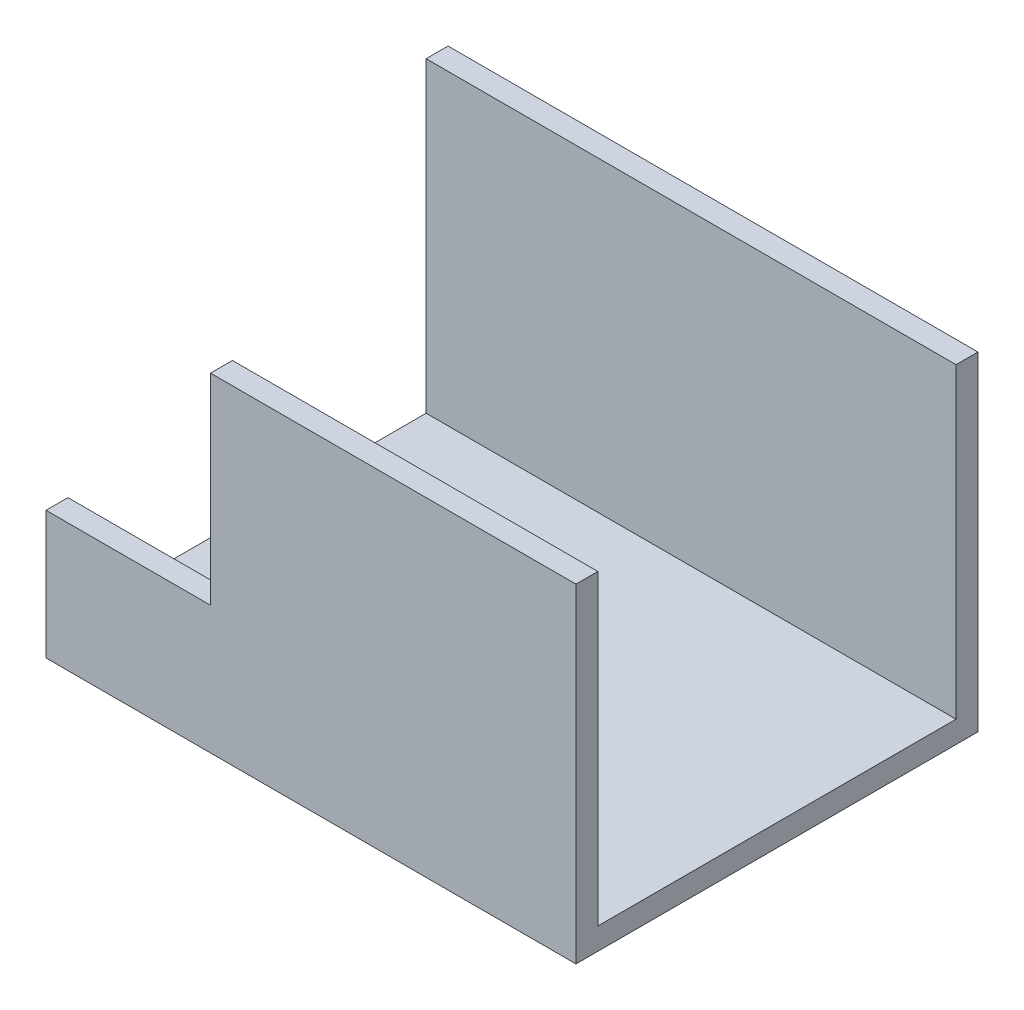
ISO-10303-21;
HEADER;
FILE_DESCRIPTION(('STEP AP214'),'2;1');
FILE_NAME('part.step','',(''),(''),'','','');
FILE_SCHEMA(('AUTOMOTIVE_DESIGN { 1 0 10303 214 1 1 1 1 }'));
ENDSEC;
DATA;
#1=APPLICATION_CONTEXT('core data for automotive mechanical design processes');
#2=APPLICATION_PROTOCOL_DEFINITION('international standard','automotive_design',2000,#1);
#3=PRODUCT_CONTEXT('',#1,'mechanical');
#4=PRODUCT('Part','Part','',(#3));
#5=PRODUCT_RELATED_PRODUCT_CATEGORY('part','',(#4));
#6=PRODUCT_DEFINITION_FORMATION('','',#4);
#7=PRODUCT_DEFINITION_CONTEXT('part definition',#1,'design');
#8=PRODUCT_DEFINITION('design','',#6,#7);
#9=PRODUCT_DEFINITION_SHAPE('','',#8);
#10=(LENGTH_UNIT() NAMED_UNIT(*) SI_UNIT(.MILLI.,.METRE.));
#11=(NAMED_UNIT(*) PLANE_ANGLE_UNIT() SI_UNIT($,.RADIAN.));
#12=(NAMED_UNIT(*) SI_UNIT($,.STERADIAN.) SOLID_ANGLE_UNIT());
#13=UNCERTAINTY_MEASURE_WITH_UNIT(LENGTH_MEASURE(1.E-05),#10,'distance_accuracy_value','');
#14=(GEOMETRIC_REPRESENTATION_CONTEXT(3) GLOBAL_UNCERTAINTY_ASSIGNED_CONTEXT((#13)) GLOBAL_UNIT_ASSIGNED_CONTEXT((#10,
#11,#12)) REPRESENTATION_CONTEXT('',''));
#15=CARTESIAN_POINT('',(0.,0.,0.));
#16=DIRECTION('',(0.,0.,1.));
#17=DIRECTION('',(1.,0.,0.));
#18=AXIS2_PLACEMENT_3D('',#15,#16,#17);
#19=CARTESIAN_POINT('',(-0.15,0.005,0.));
#20=DIRECTION('',(0.,-1.,0.));
#21=DIRECTION('',(0.707106781186548,0.,0.707106781186548));
#22=AXIS2_PLACEMENT_3D('',#19,#20,#21);
#23=PLANE('',#22);
#24=DIRECTION('',(1.,0.,0.));
#25=VECTOR('',#24,1.);
#26=CARTESIAN_POINT('',(-0.375,0.005,0.03));
#27=LINE('',#26,#25);
#28=CARTESIAN_POINT('',(-0.375,0.005,0.03));
#29=VERTEX_POINT('',#28);
#30=CARTESIAN_POINT('',(0.35,0.005,0.03));
#31=VERTEX_POINT('',#30);
#32=EDGE_CURVE('E154',#29,#31,#27,.T.);
#33=ORIENTED_EDGE('',*,*,#32,.F.);
#34=DIRECTION('',(0.,0.,-1.));
#35=VECTOR('',#34,1.);
#36=CARTESIAN_POINT('',(-0.375,0.005,0.52));
#37=LINE('',#36,#35);
#38=CARTESIAN_POINT('',(-0.375,0.00500000000000011,0.52));
#39=VERTEX_POINT('',#38);
#40=EDGE_CURVE('E35',#39,#29,#37,.T.);
#41=ORIENTED_EDGE('',*,*,#40,.F.);
#42=DIRECTION('',(1.,0.,0.));
#43=VECTOR('',#42,1.);
#44=CARTESIAN_POINT('',(-0.375,0.00500000000000012,0.52));
#45=LINE('',#44,#43);
#46=CARTESIAN_POINT('',(0.35,0.005,0.52));
#47=VERTEX_POINT('',#46);
#48=EDGE_CURVE('E11',#39,#47,#45,.T.);
#49=ORIENTED_EDGE('',*,*,#48,.T.);
#50=DIRECTION('',(0.,0.,1.));
#51=VECTOR('',#50,1.);
#52=CARTESIAN_POINT('',(0.35,0.005,0.03));
#53=LINE('',#52,#51);
#54=EDGE_CURVE('E140',#31,#47,#53,.T.);
#55=ORIENTED_EDGE('',*,*,#54,.F.);
#56=EDGE_LOOP('',(#33,#41,#49,#55));
#57=FACE_BOUND('',#56,.T.);
#58=ADVANCED_FACE('F16',(#57),#23,.F.);
#59=CARTESIAN_POINT('',(0.,0.,0.52));
#60=DIRECTION('',(0.,0.,1.));
#61=DIRECTION('',(0.707106781186548,0.707106781186548,0.));
#62=AXIS2_PLACEMENT_3D('',#59,#60,#61);
#63=PLANE('',#62);
#64=DIRECTION('',(-1.,0.,0.));
#65=VECTOR('',#64,1.);
#66=CARTESIAN_POINT('',(0.35,0.425,0.52));
#67=LINE('',#66,#65);
#68=CARTESIAN_POINT('',(0.35,0.425,0.52));
#69=VERTEX_POINT('',#68);
#70=CARTESIAN_POINT('',(-0.15,0.425,0.52));
#71=VERTEX_POINT('',#70);
#72=EDGE_CURVE('E133',#69,#71,#67,.T.);
#73=ORIENTED_EDGE('',*,*,#72,.F.);
#74=DIRECTION('',(0.,1.,0.));
#75=VECTOR('',#74,1.);
#76=CARTESIAN_POINT('',(0.35,0.005,0.52));
#77=LINE('',#76,#75);
#78=EDGE_CURVE('E144',#47,#69,#77,.T.);
#79=ORIENTED_EDGE('',*,*,#78,.F.);
#80=ORIENTED_EDGE('',*,*,#48,.F.);
#81=DIRECTION('',(0.,-1.,0.));
#82=VECTOR('',#81,1.);
#83=CARTESIAN_POINT('',(-0.375,0.15,0.52));
#84=LINE('',#83,#82);
#85=CARTESIAN_POINT('',(-0.375,0.15,0.52));
#86=VERTEX_POINT('',#85);
#87=EDGE_CURVE('E136',#86,#39,#84,.T.);
#88=ORIENTED_EDGE('',*,*,#87,.F.);
#89=DIRECTION('',(-1.,0.,0.));
#90=VECTOR('',#89,1.);
#91=CARTESIAN_POINT('',(-0.15,0.15,0.52));
#92=LINE('',#91,#90);
#93=CARTESIAN_POINT('',(-0.15,0.15,0.52));
#94=VERTEX_POINT('',#93);
#95=EDGE_CURVE('E130',#94,#86,#92,.T.);
#96=ORIENTED_EDGE('',*,*,#95,.F.);
#97=DIRECTION('',(0.,-1.,0.));
#98=VECTOR('',#97,1.);
#99=CARTESIAN_POINT('',(-0.15,0.425,0.52));
#100=LINE('',#99,#98);
#101=EDGE_CURVE('E118',#71,#94,#100,.T.);
#102=ORIENTED_EDGE('',*,*,#101,.F.);
#103=EDGE_LOOP('',(#73,#79,#80,#88,#96,#102));
#104=FACE_BOUND('',#103,.T.);
#105=ADVANCED_FACE('F177',(#104),#63,.F.);
#106=CARTESIAN_POINT('',(0.,0.,0.03));
#107=DIRECTION('',(0.,0.,1.));
#108=DIRECTION('',(0.707106781186548,0.707106781186548,0.));
#109=AXIS2_PLACEMENT_3D('',#106,#107,#108);
#110=PLANE('',#109);
#111=DIRECTION('',(0.,1.,0.));
#112=VECTOR('',#111,1.);
#113=CARTESIAN_POINT('',(0.35,0.005,0.03));
#114=LINE('',#113,#112);
#115=CARTESIAN_POINT('',(0.35,0.425,0.03));
#116=VERTEX_POINT('',#115);
#117=EDGE_CURVE('E26',#31,#116,#114,.T.);
#118=ORIENTED_EDGE('',*,*,#117,.T.);
#119=DIRECTION('',(-1.,0.,0.));
#120=VECTOR('',#119,1.);
#121=CARTESIAN_POINT('',(0.35,0.425,0.03));
#122=LINE('',#121,#120);
#123=CARTESIAN_POINT('',(-0.375,0.425,0.03));
#124=VERTEX_POINT('',#123);
#125=EDGE_CURVE('E151',#116,#124,#122,.T.);
#126=ORIENTED_EDGE('',*,*,#125,.T.);
#127=DIRECTION('',(0.,1.,0.));
#128=VECTOR('',#127,1.);
#129=CARTESIAN_POINT('',(-0.375,0.005,0.03));
#130=LINE('',#129,#128);
#131=EDGE_CURVE('E147',#29,#124,#130,.T.);
#132=ORIENTED_EDGE('',*,*,#131,.F.);
#133=ORIENTED_EDGE('',*,*,#32,.T.);
#134=EDGE_LOOP('',(#118,#126,#132,#133));
#135=FACE_BOUND('',#134,.T.);
#136=ADVANCED_FACE('F189',(#135),#110,.T.);
#137=CARTESIAN_POINT('',(0.35,0.425,0.));
#138=DIRECTION('',(0.,1.,0.));
#139=DIRECTION('',(0.707106781186548,0.,0.707106781186548));
#140=AXIS2_PLACEMENT_3D('',#137,#138,#139);
#141=PLANE('',#140);
#142=ORIENTED_EDGE('',*,*,#125,.F.);
#143=DIRECTION('',(0.,0.,1.));
#144=VECTOR('',#143,1.);
#145=CARTESIAN_POINT('',(0.35,0.425,0.));
#146=LINE('',#145,#144);
#147=CARTESIAN_POINT('',(0.35,0.425,0.));
#148=VERTEX_POINT('',#147);
#149=EDGE_CURVE('E157',#148,#116,#146,.T.);
#150=ORIENTED_EDGE('',*,*,#149,.F.);
#151=DIRECTION('',(-1.,0.,0.));
#152=VECTOR('',#151,1.);
#153=CARTESIAN_POINT('',(0.35,0.425,0.));
#154=LINE('',#153,#152);
#155=CARTESIAN_POINT('',(-0.375,0.425,0.));
#156=VERTEX_POINT('',#155);
#157=EDGE_CURVE('E161',#148,#156,#154,.T.);
#158=ORIENTED_EDGE('',*,*,#157,.T.);
#159=DIRECTION('',(0.,0.,-1.));
#160=VECTOR('',#159,1.);
#161=CARTESIAN_POINT('',(-0.375,0.425,0.03));
#162=LINE('',#161,#160);
#163=EDGE_CURVE('E156',#124,#156,#162,.T.);
#164=ORIENTED_EDGE('',*,*,#163,.F.);
#165=EDGE_LOOP('',(#142,#150,#158,#164));
#166=FACE_BOUND('',#165,.T.);
#167=ADVANCED_FACE('F193',(#166),#141,.T.);
#168=CARTESIAN_POINT('',(0.,0.,0.));
#169=DIRECTION('',(0.,0.,1.));
#170=DIRECTION('',(0.707106781186548,0.707106781186548,0.));
#171=AXIS2_PLACEMENT_3D('',#168,#169,#170);
#172=PLANE('',#171);
#173=DIRECTION('',(0.,1.,0.));
#174=VECTOR('',#173,1.);
#175=CARTESIAN_POINT('',(0.35,-0.025,0.));
#176=LINE('',#175,#174);
#177=CARTESIAN_POINT('',(0.35,-0.025,0.));
#178=VERTEX_POINT('',#177);
#179=EDGE_CURVE('E160',#178,#148,#176,.T.);
#180=ORIENTED_EDGE('',*,*,#179,.F.);
#181=DIRECTION('',(1.,0.,0.));
#182=VECTOR('',#181,1.);
#183=CARTESIAN_POINT('',(-0.375,-0.025,0.));
#184=LINE('',#183,#182);
#185=CARTESIAN_POINT('',(-0.375,-0.025,0.));
#186=VERTEX_POINT('',#185);
#187=EDGE_CURVE('E107',#186,#178,#184,.T.);
#188=ORIENTED_EDGE('',*,*,#187,.F.);
#189=DIRECTION('',(0.,-1.,0.));
#190=VECTOR('',#189,1.);
#191=CARTESIAN_POINT('',(-0.375,0.425,0.));
#192=LINE('',#191,#190);
#193=EDGE_CURVE('E127',#156,#186,#192,.T.);
#194=ORIENTED_EDGE('',*,*,#193,.F.);
#195=ORIENTED_EDGE('',*,*,#157,.F.);
#196=EDGE_LOOP('',(#180,#188,#194,#195));
#197=FACE_BOUND('',#196,.T.);
#198=ADVANCED_FACE('F197',(#197),#172,.F.);
#199=CARTESIAN_POINT('',(0.,0.,0.55));
#200=DIRECTION('',(0.,0.,1.));
#201=DIRECTION('',(0.707106781186548,0.707106781186548,0.));
#202=AXIS2_PLACEMENT_3D('',#199,#200,#201);
#203=PLANE('',#202);
#204=DIRECTION('',(-1.,0.,0.));
#205=VECTOR('',#204,1.);
#206=CARTESIAN_POINT('',(0.35,0.425,0.55));
#207=LINE('',#206,#205);
#208=CARTESIAN_POINT('',(0.35,0.425,0.55));
#209=VERTEX_POINT('',#208);
#210=CARTESIAN_POINT('',(-0.15,0.425,0.55));
#211=VERTEX_POINT('',#210);
#212=EDGE_CURVE('E164',#209,#211,#207,.T.);
#213=ORIENTED_EDGE('',*,*,#212,.T.);
#214=DIRECTION('',(0.,-1.,0.));
#215=VECTOR('',#214,1.);
#216=CARTESIAN_POINT('',(-0.15,0.425,0.55));
#217=LINE('',#216,#215);
#218=CARTESIAN_POINT('',(-0.15,0.15,0.55));
#219=VERTEX_POINT('',#218);
#220=EDGE_CURVE('E169',#211,#219,#217,.T.);
#221=ORIENTED_EDGE('',*,*,#220,.T.);
#222=DIRECTION('',(-1.,0.,0.));
#223=VECTOR('',#222,1.);
#224=CARTESIAN_POINT('',(-0.15,0.15,0.55));
#225=LINE('',#224,#223);
#226=CARTESIAN_POINT('',(-0.375,0.15,0.55));
#227=VERTEX_POINT('',#226);
#228=EDGE_CURVE('E113',#219,#227,#225,.T.);
#229=ORIENTED_EDGE('',*,*,#228,.T.);
#230=DIRECTION('',(0.,1.,0.));
#231=VECTOR('',#230,1.);
#232=CARTESIAN_POINT('',(-0.375,-0.025,0.55));
#233=LINE('',#232,#231);
#234=CARTESIAN_POINT('',(-0.375,-0.025,0.55));
#235=VERTEX_POINT('',#234);
#236=EDGE_CURVE('E90',#235,#227,#233,.T.);
#237=ORIENTED_EDGE('',*,*,#236,.F.);
#238=DIRECTION('',(1.,0.,0.));
#239=VECTOR('',#238,1.);
#240=CARTESIAN_POINT('',(-0.375,-0.025,0.55));
#241=LINE('',#240,#239);
#242=CARTESIAN_POINT('',(0.35,-0.025,0.55));
#243=VERTEX_POINT('',#242);
#244=EDGE_CURVE('E106',#235,#243,#241,.T.);
#245=ORIENTED_EDGE('',*,*,#244,.T.);
#246=DIRECTION('',(0.,1.,0.));
#247=VECTOR('',#246,1.);
#248=CARTESIAN_POINT('',(0.35,-0.025,0.55));
#249=LINE('',#248,#247);
#250=EDGE_CURVE('E96',#243,#209,#249,.T.);
#251=ORIENTED_EDGE('',*,*,#250,.T.);
#252=EDGE_LOOP('',(#213,#221,#229,#237,#245,#251));
#253=FACE_BOUND('',#252,.T.);
#254=ADVANCED_FACE('F109',(#253),#203,.T.);
#255=CARTESIAN_POINT('',(-0.15,-0.025,0.));
#256=DIRECTION('',(0.,-1.,0.));
#257=DIRECTION('',(0.707106781186548,0.,0.707106781186548));
#258=AXIS2_PLACEMENT_3D('',#255,#256,#257);
#259=PLANE('',#258);
#260=ORIENTED_EDGE('',*,*,#187,.T.);
#261=DIRECTION('',(0.,0.,1.));
#262=VECTOR('',#261,1.);
#263=CARTESIAN_POINT('',(0.35,-0.025,0.));
#264=LINE('',#263,#262);
#265=EDGE_CURVE('E101',#178,#243,#264,.T.);
#266=ORIENTED_EDGE('',*,*,#265,.T.);
#267=ORIENTED_EDGE('',*,*,#244,.F.);
#268=DIRECTION('',(0.,0.,1.));
#269=VECTOR('',#268,1.);
#270=CARTESIAN_POINT('',(-0.375,-0.025,0.));
#271=LINE('',#270,#269);
#272=EDGE_CURVE('E125',#186,#235,#271,.T.);
#273=ORIENTED_EDGE('',*,*,#272,.F.);
#274=EDGE_LOOP('',(#260,#266,#267,#273));
#275=FACE_BOUND('',#274,.T.);
#276=ADVANCED_FACE('F116',(#275),#259,.T.);
#277=CARTESIAN_POINT('',(-0.15,0.425,0.));
#278=DIRECTION('',(-1.,0.,0.));
#279=DIRECTION('',(0.,0.707106781186548,0.707106781186548));
#280=AXIS2_PLACEMENT_3D('',#277,#278,#279);
#281=PLANE('',#280);
#282=DIRECTION('',(0.,0.,-1.));
#283=VECTOR('',#282,1.);
#284=CARTESIAN_POINT('',(-0.15,0.15,0.55));
#285=LINE('',#284,#283);
#286=EDGE_CURVE('E122',#219,#94,#285,.T.);
#287=ORIENTED_EDGE('',*,*,#286,.F.);
#288=ORIENTED_EDGE('',*,*,#220,.F.);
#289=DIRECTION('',(0.,0.,1.));
#290=VECTOR('',#289,1.);
#291=CARTESIAN_POINT('',(-0.15,0.425,0.52));
#292=LINE('',#291,#290);
#293=EDGE_CURVE('E131',#71,#211,#292,.T.);
#294=ORIENTED_EDGE('',*,*,#293,.F.);
#295=ORIENTED_EDGE('',*,*,#101,.T.);
#296=EDGE_LOOP('',(#287,#288,#294,#295));
#297=FACE_BOUND('',#296,.T.);
#298=ADVANCED_FACE('F181',(#297),#281,.T.);
#299=CARTESIAN_POINT('',(-0.15,0.15,0.55));
#300=DIRECTION('',(0.,1.,0.));
#301=DIRECTION('',(0.707106781186548,0.,0.707106781186548));
#302=AXIS2_PLACEMENT_3D('',#299,#300,#301);
#303=PLANE('',#302);
#304=ORIENTED_EDGE('',*,*,#286,.T.);
#305=ORIENTED_EDGE('',*,*,#95,.T.);
#306=DIRECTION('',(0.,0.,-1.));
#307=VECTOR('',#306,1.);
#308=CARTESIAN_POINT('',(-0.375,0.15,0.55));
#309=LINE('',#308,#307);
#310=EDGE_CURVE('E134',#227,#86,#309,.T.);
#311=ORIENTED_EDGE('',*,*,#310,.F.);
#312=ORIENTED_EDGE('',*,*,#228,.F.);
#313=EDGE_LOOP('',(#304,#305,#311,#312));
#314=FACE_BOUND('',#313,.T.);
#315=ADVANCED_FACE('F174',(#314),#303,.T.);
#316=CARTESIAN_POINT('',(-0.375,0.,0.));
#317=DIRECTION('',(-1.,0.,0.));
#318=DIRECTION('',(0.,0.707106781186548,0.707106781186548));
#319=AXIS2_PLACEMENT_3D('',#316,#317,#318);
#320=PLANE('',#319);
#321=ORIENTED_EDGE('',*,*,#131,.T.);
#322=ORIENTED_EDGE('',*,*,#163,.T.);
#323=ORIENTED_EDGE('',*,*,#193,.T.);
#324=ORIENTED_EDGE('',*,*,#272,.T.);
#325=ORIENTED_EDGE('',*,*,#236,.T.);
#326=ORIENTED_EDGE('',*,*,#310,.T.);
#327=ORIENTED_EDGE('',*,*,#87,.T.);
#328=ORIENTED_EDGE('',*,*,#40,.T.);
#329=EDGE_LOOP('',(#321,#322,#323,#324,#325,#326,#327,#328));
#330=FACE_BOUND('',#329,.T.);
#331=ADVANCED_FACE('F198',(#330),#320,.T.);
#332=CARTESIAN_POINT('',(0.35,-0.025,0.));
#333=DIRECTION('',(1.,0.,0.));
#334=DIRECTION('',(0.,0.707106781186548,0.707106781186548));
#335=AXIS2_PLACEMENT_3D('',#332,#333,#334);
#336=PLANE('',#335);
#337=ORIENTED_EDGE('',*,*,#117,.F.);
#338=ORIENTED_EDGE('',*,*,#54,.T.);
#339=ORIENTED_EDGE('',*,*,#78,.T.);
#340=DIRECTION('',(0.,0.,1.));
#341=VECTOR('',#340,1.);
#342=CARTESIAN_POINT('',(0.35,0.425,0.52));
#343=LINE('',#342,#341);
#344=EDGE_CURVE('E20',#69,#209,#343,.T.);
#345=ORIENTED_EDGE('',*,*,#344,.T.);
#346=ORIENTED_EDGE('',*,*,#250,.F.);
#347=ORIENTED_EDGE('',*,*,#265,.F.);
#348=ORIENTED_EDGE('',*,*,#179,.T.);
#349=ORIENTED_EDGE('',*,*,#149,.T.);
#350=EDGE_LOOP('',(#337,#338,#339,#345,#346,#347,#348,#349));
#351=FACE_BOUND('',#350,.T.);
#352=ADVANCED_FACE('F98',(#351),#336,.T.);
#353=CARTESIAN_POINT('',(0.35,0.425,0.));
#354=DIRECTION('',(0.,1.,0.));
#355=DIRECTION('',(0.707106781186548,0.,0.707106781186548));
#356=AXIS2_PLACEMENT_3D('',#353,#354,#355);
#357=PLANE('',#356);
#358=ORIENTED_EDGE('',*,*,#72,.T.);
#359=ORIENTED_EDGE('',*,*,#293,.T.);
#360=ORIENTED_EDGE('',*,*,#212,.F.);
#361=ORIENTED_EDGE('',*,*,#344,.F.);
#362=EDGE_LOOP('',(#358,#359,#360,#361));
#363=FACE_BOUND('',#362,.T.);
#364=ADVANCED_FACE('F18',(#363),#357,.T.);
#365=CLOSED_SHELL('',(#58,#105,#136,#167,#198,#254,#276,#298,#315,#331,#352,#364));
#366=MANIFOLD_SOLID_BREP('B1',#365);
#367=ADVANCED_BREP_SHAPE_REPRESENTATION('',(#18,#366),#14);
#368=SHAPE_DEFINITION_REPRESENTATION(#9,#367);
ENDSEC;
END-ISO-10303-21;
